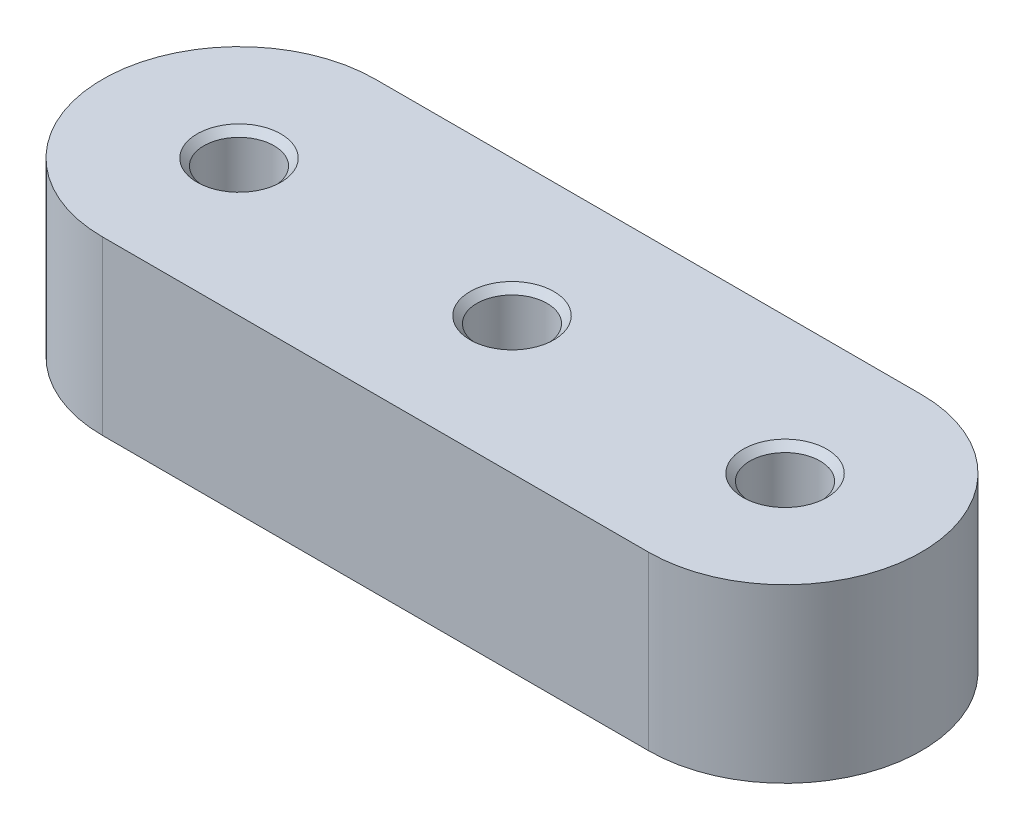
ISO-10303-21;
HEADER;
FILE_DESCRIPTION(('STEP AP214'),'2;1');
FILE_NAME('part.step','',(''),(''),'','','');
FILE_SCHEMA(('AUTOMOTIVE_DESIGN { 1 0 10303 214 1 1 1 1 }'));
ENDSEC;
DATA;
#1=APPLICATION_CONTEXT('core data for automotive mechanical design processes');
#2=APPLICATION_PROTOCOL_DEFINITION('international standard','automotive_design',2000,#1);
#3=PRODUCT_CONTEXT('',#1,'mechanical');
#4=PRODUCT('Part','Part','',(#3));
#5=PRODUCT_RELATED_PRODUCT_CATEGORY('part','',(#4));
#6=PRODUCT_DEFINITION_FORMATION('','',#4);
#7=PRODUCT_DEFINITION_CONTEXT('part definition',#1,'design');
#8=PRODUCT_DEFINITION('design','',#6,#7);
#9=PRODUCT_DEFINITION_SHAPE('','',#8);
#10=(LENGTH_UNIT() NAMED_UNIT(*) SI_UNIT(.MILLI.,.METRE.));
#11=(NAMED_UNIT(*) PLANE_ANGLE_UNIT() SI_UNIT($,.RADIAN.));
#12=(NAMED_UNIT(*) SI_UNIT($,.STERADIAN.) SOLID_ANGLE_UNIT());
#13=UNCERTAINTY_MEASURE_WITH_UNIT(LENGTH_MEASURE(1.E-05),#10,'distance_accuracy_value','');
#14=(GEOMETRIC_REPRESENTATION_CONTEXT(3) GLOBAL_UNCERTAINTY_ASSIGNED_CONTEXT((#13)) GLOBAL_UNIT_ASSIGNED_CONTEXT((#10,
#11,#12)) REPRESENTATION_CONTEXT('',''));
#15=CARTESIAN_POINT('',(0.,0.,0.));
#16=DIRECTION('',(0.,0.,1.));
#17=DIRECTION('',(1.,0.,0.));
#18=AXIS2_PLACEMENT_3D('',#15,#16,#17);
#19=CARTESIAN_POINT('',(-25.4,-16.,0.));
#20=DIRECTION('',(0.,1.,0.));
#21=DIRECTION('',(0.,0.,1.));
#22=AXIS2_PLACEMENT_3D('',#19,#20,#21);
#23=CYLINDRICAL_SURFACE('',#22,12.7);
#24=CARTESIAN_POINT('',(-25.4,0.,0.));
#25=DIRECTION('',(0.,1.,0.));
#26=DIRECTION('',(0.,0.,1.));
#27=AXIS2_PLACEMENT_3D('',#24,#25,#26);
#28=CIRCLE('',#27,12.7);
#29=CARTESIAN_POINT('',(-25.4,0.,-12.7));
#30=VERTEX_POINT('',#29);
#31=CARTESIAN_POINT('',(-25.4,0.,12.7));
#32=VERTEX_POINT('',#31);
#33=EDGE_CURVE('E97',#30,#32,#28,.T.);
#34=ORIENTED_EDGE('',*,*,#33,.F.);
#35=DIRECTION('',(0.,1.,0.));
#36=VECTOR('',#35,1.);
#37=CARTESIAN_POINT('',(-25.4,-16.,-12.7));
#38=LINE('',#37,#36);
#39=CARTESIAN_POINT('',(-25.4,-16.,-12.7));
#40=VERTEX_POINT('',#39);
#41=EDGE_CURVE('E11',#40,#30,#38,.T.);
#42=ORIENTED_EDGE('',*,*,#41,.F.);
#43=CARTESIAN_POINT('',(-25.4,-16.,0.));
#44=DIRECTION('',(0.,1.,0.));
#45=DIRECTION('',(0.,0.,1.));
#46=AXIS2_PLACEMENT_3D('',#43,#44,#45);
#47=CIRCLE('',#46,12.7);
#48=CARTESIAN_POINT('',(-25.4,-16.,12.7));
#49=VERTEX_POINT('',#48);
#50=EDGE_CURVE('E90',#40,#49,#47,.T.);
#51=ORIENTED_EDGE('',*,*,#50,.T.);
#52=DIRECTION('',(0.,1.,0.));
#53=VECTOR('',#52,1.);
#54=CARTESIAN_POINT('',(-25.4,-16.,12.7));
#55=LINE('',#54,#53);
#56=EDGE_CURVE('E35',#49,#32,#55,.T.);
#57=ORIENTED_EDGE('',*,*,#56,.T.);
#58=EDGE_LOOP('',(#34,#42,#51,#57));
#59=FACE_BOUND('',#58,.T.);
#60=ADVANCED_FACE('F32',(#59),#23,.T.);
#61=CARTESIAN_POINT('',(-25.4,-16.,-12.7));
#62=DIRECTION('',(0.,0.,-1.));
#63=DIRECTION('',(-1.,0.,0.));
#64=AXIS2_PLACEMENT_3D('',#61,#62,#63);
#65=PLANE('',#64);
#66=DIRECTION('',(-1.,0.,0.));
#67=VECTOR('',#66,1.);
#68=CARTESIAN_POINT('',(-25.4,0.,-12.7));
#69=LINE('',#68,#67);
#70=CARTESIAN_POINT('',(25.4,0.,-12.7));
#71=VERTEX_POINT('',#70);
#72=EDGE_CURVE('E92',#71,#30,#69,.T.);
#73=ORIENTED_EDGE('',*,*,#72,.F.);
#74=DIRECTION('',(0.,1.,0.));
#75=VECTOR('',#74,1.);
#76=CARTESIAN_POINT('',(25.4,-16.,-12.7));
#77=LINE('',#76,#75);
#78=CARTESIAN_POINT('',(25.4,-16.,-12.7));
#79=VERTEX_POINT('',#78);
#80=EDGE_CURVE('E41',#79,#71,#77,.T.);
#81=ORIENTED_EDGE('',*,*,#80,.F.);
#82=DIRECTION('',(-1.,0.,0.));
#83=VECTOR('',#82,1.);
#84=CARTESIAN_POINT('',(-25.4,-16.,-12.7));
#85=LINE('',#84,#83);
#86=EDGE_CURVE('E87',#79,#40,#85,.T.);
#87=ORIENTED_EDGE('',*,*,#86,.T.);
#88=ORIENTED_EDGE('',*,*,#41,.T.);
#89=EDGE_LOOP('',(#73,#81,#87,#88));
#90=FACE_BOUND('',#89,.T.);
#91=ADVANCED_FACE('F108',(#90),#65,.T.);
#92=CARTESIAN_POINT('',(25.4,-16.,0.));
#93=DIRECTION('',(0.,1.,0.));
#94=DIRECTION('',(0.,0.,1.));
#95=AXIS2_PLACEMENT_3D('',#92,#93,#94);
#96=CYLINDRICAL_SURFACE('',#95,12.7);
#97=CARTESIAN_POINT('',(25.4,0.,0.));
#98=DIRECTION('',(0.,1.,0.));
#99=DIRECTION('',(0.,0.,1.));
#100=AXIS2_PLACEMENT_3D('',#97,#98,#99);
#101=CIRCLE('',#100,12.7);
#102=CARTESIAN_POINT('',(25.4,0.,12.7));
#103=VERTEX_POINT('',#102);
#104=EDGE_CURVE('E82',#103,#71,#101,.T.);
#105=ORIENTED_EDGE('',*,*,#104,.F.);
#106=DIRECTION('',(0.,1.,0.));
#107=VECTOR('',#106,1.);
#108=CARTESIAN_POINT('',(25.4,-16.,12.7));
#109=LINE('',#108,#107);
#110=CARTESIAN_POINT('',(25.4,-16.,12.7));
#111=VERTEX_POINT('',#110);
#112=EDGE_CURVE('E77',#111,#103,#109,.T.);
#113=ORIENTED_EDGE('',*,*,#112,.F.);
#114=CARTESIAN_POINT('',(25.4,-16.,0.));
#115=DIRECTION('',(0.,1.,0.));
#116=DIRECTION('',(0.,0.,1.));
#117=AXIS2_PLACEMENT_3D('',#114,#115,#116);
#118=CIRCLE('',#117,12.7);
#119=EDGE_CURVE('E80',#111,#79,#118,.T.);
#120=ORIENTED_EDGE('',*,*,#119,.T.);
#121=ORIENTED_EDGE('',*,*,#80,.T.);
#122=EDGE_LOOP('',(#105,#113,#120,#121));
#123=FACE_BOUND('',#122,.T.);
#124=ADVANCED_FACE('F79',(#123),#96,.T.);
#125=CARTESIAN_POINT('',(-25.4,-16.,12.7));
#126=DIRECTION('',(0.,0.,1.));
#127=DIRECTION('',(1.,0.,0.));
#128=AXIS2_PLACEMENT_3D('',#125,#126,#127);
#129=PLANE('',#128);
#130=DIRECTION('',(1.,0.,0.));
#131=VECTOR('',#130,1.);
#132=CARTESIAN_POINT('',(-25.4,0.,12.7));
#133=LINE('',#132,#131);
#134=EDGE_CURVE('E100',#32,#103,#133,.T.);
#135=ORIENTED_EDGE('',*,*,#134,.F.);
#136=ORIENTED_EDGE('',*,*,#56,.F.);
#137=DIRECTION('',(1.,0.,0.));
#138=VECTOR('',#137,1.);
#139=CARTESIAN_POINT('',(-25.4,-16.,12.7));
#140=LINE('',#139,#138);
#141=EDGE_CURVE('E86',#49,#111,#140,.T.);
#142=ORIENTED_EDGE('',*,*,#141,.T.);
#143=ORIENTED_EDGE('',*,*,#112,.T.);
#144=EDGE_LOOP('',(#135,#136,#142,#143));
#145=FACE_BOUND('',#144,.T.);
#146=ADVANCED_FACE('F89',(#145),#129,.T.);
#147=CARTESIAN_POINT('',(-25.4,-16.,0.));
#148=DIRECTION('',(0.,1.,0.));
#149=DIRECTION('',(0.,0.,1.));
#150=AXIS2_PLACEMENT_3D('',#147,#148,#149);
#151=PLANE('',#150);
#152=CARTESIAN_POINT('',(0.,-16.,0.));
#153=DIRECTION('',(0.,1.,0.));
#154=DIRECTION('',(0.,0.,1.));
#155=AXIS2_PLACEMENT_3D('',#152,#153,#154);
#156=CIRCLE('',#155,3.8989);
#157=CARTESIAN_POINT('',(0.,-16.,3.8989));
#158=VERTEX_POINT('',#157);
#159=EDGE_CURVE('E174',#158,#158,#156,.T.);
#160=ORIENTED_EDGE('',*,*,#159,.T.);
#161=EDGE_LOOP('',(#160));
#162=FACE_BOUND('',#161,.T.);
#163=CARTESIAN_POINT('',(-25.4,-16.,0.));
#164=DIRECTION('',(0.,1.,0.));
#165=DIRECTION('',(0.,0.,1.));
#166=AXIS2_PLACEMENT_3D('',#163,#164,#165);
#167=CIRCLE('',#166,3.8989);
#168=CARTESIAN_POINT('',(-25.4,-16.,3.89889999999998));
#169=VERTEX_POINT('',#168);
#170=EDGE_CURVE('E182',#169,#169,#167,.T.);
#171=ORIENTED_EDGE('',*,*,#170,.T.);
#172=EDGE_LOOP('',(#171));
#173=FACE_BOUND('',#172,.T.);
#174=CARTESIAN_POINT('',(25.4,-16.,0.));
#175=DIRECTION('',(0.,1.,0.));
#176=DIRECTION('',(0.,0.,1.));
#177=AXIS2_PLACEMENT_3D('',#174,#175,#176);
#178=CIRCLE('',#177,3.8989);
#179=CARTESIAN_POINT('',(25.4,-16.,3.89890000000001));
#180=VERTEX_POINT('',#179);
#181=EDGE_CURVE('E194',#180,#180,#178,.T.);
#182=ORIENTED_EDGE('',*,*,#181,.T.);
#183=EDGE_LOOP('',(#182));
#184=FACE_BOUND('',#183,.T.);
#185=ORIENTED_EDGE('',*,*,#50,.F.);
#186=ORIENTED_EDGE('',*,*,#86,.F.);
#187=ORIENTED_EDGE('',*,*,#119,.F.);
#188=ORIENTED_EDGE('',*,*,#141,.F.);
#189=EDGE_LOOP('',(#185,#186,#187,#188));
#190=FACE_BOUND('',#189,.T.);
#191=ADVANCED_FACE('F85',(#162,#173,#184,#190),#151,.F.);
#192=CARTESIAN_POINT('',(-25.4,0.,0.));
#193=DIRECTION('',(0.,1.,0.));
#194=DIRECTION('',(0.,0.,1.));
#195=AXIS2_PLACEMENT_3D('',#192,#193,#194);
#196=PLANE('',#195);
#197=CARTESIAN_POINT('',(0.,0.,0.));
#198=DIRECTION('',(0.,1.,0.));
#199=DIRECTION('',(0.,0.,1.));
#200=AXIS2_PLACEMENT_3D('',#197,#198,#199);
#201=CIRCLE('',#200,3.8989);
#202=CARTESIAN_POINT('',(0.,0.,3.8989));
#203=VERTEX_POINT('',#202);
#204=EDGE_CURVE('E173',#203,#203,#201,.T.);
#205=ORIENTED_EDGE('',*,*,#204,.F.);
#206=EDGE_LOOP('',(#205));
#207=FACE_BOUND('',#206,.T.);
#208=CARTESIAN_POINT('',(-25.4,0.,0.));
#209=DIRECTION('',(0.,1.,0.));
#210=DIRECTION('',(0.,0.,1.));
#211=AXIS2_PLACEMENT_3D('',#208,#209,#210);
#212=CIRCLE('',#211,3.8989);
#213=CARTESIAN_POINT('',(-25.4,0.,3.89889999999999));
#214=VERTEX_POINT('',#213);
#215=EDGE_CURVE('E185',#214,#214,#212,.T.);
#216=ORIENTED_EDGE('',*,*,#215,.F.);
#217=EDGE_LOOP('',(#216));
#218=FACE_BOUND('',#217,.T.);
#219=CARTESIAN_POINT('',(25.4,0.,0.));
#220=DIRECTION('',(0.,1.,0.));
#221=DIRECTION('',(0.,0.,1.));
#222=AXIS2_PLACEMENT_3D('',#219,#220,#221);
#223=CIRCLE('',#222,3.8989);
#224=CARTESIAN_POINT('',(25.4,0.,3.89890000000002));
#225=VERTEX_POINT('',#224);
#226=EDGE_CURVE('E197',#225,#225,#223,.T.);
#227=ORIENTED_EDGE('',*,*,#226,.F.);
#228=EDGE_LOOP('',(#227));
#229=FACE_BOUND('',#228,.T.);
#230=ORIENTED_EDGE('',*,*,#33,.T.);
#231=ORIENTED_EDGE('',*,*,#134,.T.);
#232=ORIENTED_EDGE('',*,*,#104,.T.);
#233=ORIENTED_EDGE('',*,*,#72,.T.);
#234=EDGE_LOOP('',(#230,#231,#232,#233));
#235=FACE_BOUND('',#234,.T.);
#236=ADVANCED_FACE('F107',(#207,#218,#229,#235),#196,.T.);
#237=CARTESIAN_POINT('',(25.4,-15.365,0.));
#238=DIRECTION('',(0.,-1.,0.));
#239=DIRECTION('',(0.,0.,-1.));
#240=AXIS2_PLACEMENT_3D('',#237,#238,#239);
#241=CONICAL_SURFACE('',#240,3.2639,0.78539816339745);
#242=ORIENTED_EDGE('',*,*,#181,.F.);
#243=EDGE_LOOP('',(#242));
#244=FACE_BOUND('',#243,.T.);
#245=CARTESIAN_POINT('',(25.4,-15.365,0.));
#246=DIRECTION('',(0.,1.,0.));
#247=DIRECTION('',(0.,0.,1.));
#248=AXIS2_PLACEMENT_3D('',#245,#246,#247);
#249=CIRCLE('',#248,3.2639);
#250=CARTESIAN_POINT('',(25.4,-15.365,3.26390000000001));
#251=VERTEX_POINT('',#250);
#252=EDGE_CURVE('E101',#251,#251,#249,.T.);
#253=ORIENTED_EDGE('',*,*,#252,.T.);
#254=EDGE_LOOP('',(#253));
#255=FACE_BOUND('',#254,.T.);
#256=ADVANCED_FACE('F126',(#244,#255),#241,.F.);
#257=CARTESIAN_POINT('',(25.4,0.,0.));
#258=DIRECTION('',(0.,1.,0.));
#259=DIRECTION('',(0.,0.,1.));
#260=AXIS2_PLACEMENT_3D('',#257,#258,#259);
#261=CYLINDRICAL_SURFACE('',#260,3.2639);
#262=ORIENTED_EDGE('',*,*,#252,.F.);
#263=EDGE_LOOP('',(#262));
#264=FACE_BOUND('',#263,.T.);
#265=CARTESIAN_POINT('',(25.4,-0.635,0.));
#266=DIRECTION('',(0.,1.,0.));
#267=DIRECTION('',(0.,0.,1.));
#268=AXIS2_PLACEMENT_3D('',#265,#266,#267);
#269=CIRCLE('',#268,3.2639);
#270=CARTESIAN_POINT('',(25.4,-0.635,3.26390000000002));
#271=VERTEX_POINT('',#270);
#272=EDGE_CURVE('E200',#271,#271,#269,.T.);
#273=ORIENTED_EDGE('',*,*,#272,.T.);
#274=EDGE_LOOP('',(#273));
#275=FACE_BOUND('',#274,.T.);
#276=ADVANCED_FACE('F133',(#264,#275),#261,.F.);
#277=CARTESIAN_POINT('',(25.4,0.,0.));
#278=DIRECTION('',(0.,1.,0.));
#279=DIRECTION('',(0.,0.,1.));
#280=AXIS2_PLACEMENT_3D('',#277,#278,#279);
#281=CONICAL_SURFACE('',#280,3.8989,0.785398163397447);
#282=ORIENTED_EDGE('',*,*,#272,.F.);
#283=EDGE_LOOP('',(#282));
#284=FACE_BOUND('',#283,.T.);
#285=ORIENTED_EDGE('',*,*,#226,.T.);
#286=EDGE_LOOP('',(#285));
#287=FACE_BOUND('',#286,.T.);
#288=ADVANCED_FACE('F137',(#284,#287),#281,.F.);
#289=CARTESIAN_POINT('',(-25.4,-15.365,0.));
#290=DIRECTION('',(0.,-1.,0.));
#291=DIRECTION('',(0.,0.,-1.));
#292=AXIS2_PLACEMENT_3D('',#289,#290,#291);
#293=CONICAL_SURFACE('',#292,3.2639,0.78539816339745);
#294=ORIENTED_EDGE('',*,*,#170,.F.);
#295=EDGE_LOOP('',(#294));
#296=FACE_BOUND('',#295,.T.);
#297=CARTESIAN_POINT('',(-25.4,-15.365,0.));
#298=DIRECTION('',(0.,1.,0.));
#299=DIRECTION('',(0.,0.,1.));
#300=AXIS2_PLACEMENT_3D('',#297,#298,#299);
#301=CIRCLE('',#300,3.2639);
#302=CARTESIAN_POINT('',(-25.4,-15.365,3.26389999999998));
#303=VERTEX_POINT('',#302);
#304=EDGE_CURVE('E191',#303,#303,#301,.T.);
#305=ORIENTED_EDGE('',*,*,#304,.T.);
#306=EDGE_LOOP('',(#305));
#307=FACE_BOUND('',#306,.T.);
#308=ADVANCED_FACE('F141',(#296,#307),#293,.F.);
#309=CARTESIAN_POINT('',(-25.4,0.,0.));
#310=DIRECTION('',(0.,1.,0.));
#311=DIRECTION('',(0.,0.,1.));
#312=AXIS2_PLACEMENT_3D('',#309,#310,#311);
#313=CYLINDRICAL_SURFACE('',#312,3.2639);
#314=ORIENTED_EDGE('',*,*,#304,.F.);
#315=EDGE_LOOP('',(#314));
#316=FACE_BOUND('',#315,.T.);
#317=CARTESIAN_POINT('',(-25.4,-0.635,0.));
#318=DIRECTION('',(0.,1.,0.));
#319=DIRECTION('',(0.,0.,1.));
#320=AXIS2_PLACEMENT_3D('',#317,#318,#319);
#321=CIRCLE('',#320,3.2639);
#322=CARTESIAN_POINT('',(-25.4,-0.635,3.26389999999999));
#323=VERTEX_POINT('',#322);
#324=EDGE_CURVE('E188',#323,#323,#321,.T.);
#325=ORIENTED_EDGE('',*,*,#324,.T.);
#326=EDGE_LOOP('',(#325));
#327=FACE_BOUND('',#326,.T.);
#328=ADVANCED_FACE('F145',(#316,#327),#313,.F.);
#329=CARTESIAN_POINT('',(-25.4,0.,0.));
#330=DIRECTION('',(0.,1.,0.));
#331=DIRECTION('',(0.,0.,1.));
#332=AXIS2_PLACEMENT_3D('',#329,#330,#331);
#333=CONICAL_SURFACE('',#332,3.8989,0.785398163397447);
#334=ORIENTED_EDGE('',*,*,#324,.F.);
#335=EDGE_LOOP('',(#334));
#336=FACE_BOUND('',#335,.T.);
#337=ORIENTED_EDGE('',*,*,#215,.T.);
#338=EDGE_LOOP('',(#337));
#339=FACE_BOUND('',#338,.T.);
#340=ADVANCED_FACE('F149',(#336,#339),#333,.F.);
#341=CARTESIAN_POINT('',(0.,-15.365,0.));
#342=DIRECTION('',(0.,-1.,0.));
#343=DIRECTION('',(0.,0.,-1.));
#344=AXIS2_PLACEMENT_3D('',#341,#342,#343);
#345=CONICAL_SURFACE('',#344,3.2639,0.785398163397449);
#346=ORIENTED_EDGE('',*,*,#159,.F.);
#347=EDGE_LOOP('',(#346));
#348=FACE_BOUND('',#347,.T.);
#349=CARTESIAN_POINT('',(0.,-15.365,0.));
#350=DIRECTION('',(0.,1.,0.));
#351=DIRECTION('',(0.,0.,1.));
#352=AXIS2_PLACEMENT_3D('',#349,#350,#351);
#353=CIRCLE('',#352,3.2639);
#354=CARTESIAN_POINT('',(0.,-15.365,3.2639));
#355=VERTEX_POINT('',#354);
#356=EDGE_CURVE('E176',#355,#355,#353,.T.);
#357=ORIENTED_EDGE('',*,*,#356,.T.);
#358=EDGE_LOOP('',(#357));
#359=FACE_BOUND('',#358,.T.);
#360=ADVANCED_FACE('F153',(#348,#359),#345,.F.);
#361=CARTESIAN_POINT('',(0.,0.,0.));
#362=DIRECTION('',(0.,1.,0.));
#363=DIRECTION('',(0.,0.,1.));
#364=AXIS2_PLACEMENT_3D('',#361,#362,#363);
#365=CYLINDRICAL_SURFACE('',#364,3.2639);
#366=ORIENTED_EDGE('',*,*,#356,.F.);
#367=EDGE_LOOP('',(#366));
#368=FACE_BOUND('',#367,.T.);
#369=CARTESIAN_POINT('',(0.,-0.635,0.));
#370=DIRECTION('',(0.,1.,0.));
#371=DIRECTION('',(0.,0.,1.));
#372=AXIS2_PLACEMENT_3D('',#369,#370,#371);
#373=CIRCLE('',#372,3.2639);
#374=CARTESIAN_POINT('',(0.,-0.635,3.2639));
#375=VERTEX_POINT('',#374);
#376=EDGE_CURVE('E170',#375,#375,#373,.T.);
#377=ORIENTED_EDGE('',*,*,#376,.T.);
#378=EDGE_LOOP('',(#377));
#379=FACE_BOUND('',#378,.T.);
#380=ADVANCED_FACE('F157',(#368,#379),#365,.F.);
#381=CARTESIAN_POINT('',(0.,0.,0.));
#382=DIRECTION('',(0.,1.,0.));
#383=DIRECTION('',(0.,0.,1.));
#384=AXIS2_PLACEMENT_3D('',#381,#382,#383);
#385=CONICAL_SURFACE('',#384,3.8989,0.785398163397448);
#386=ORIENTED_EDGE('',*,*,#376,.F.);
#387=EDGE_LOOP('',(#386));
#388=FACE_BOUND('',#387,.T.);
#389=ORIENTED_EDGE('',*,*,#204,.T.);
#390=EDGE_LOOP('',(#389));
#391=FACE_BOUND('',#390,.T.);
#392=ADVANCED_FACE('F161',(#388,#391),#385,.F.);
#393=CLOSED_SHELL('',(#60,#91,#124,#146,#191,#236,#256,#276,#288,#308,#328,#340,#360,#380,#392));
#394=MANIFOLD_SOLID_BREP('B2',#393);
#395=ADVANCED_BREP_SHAPE_REPRESENTATION('',(#18,#394),#14);
#396=SHAPE_DEFINITION_REPRESENTATION(#9,#395);
ENDSEC;
END-ISO-10303-21;
